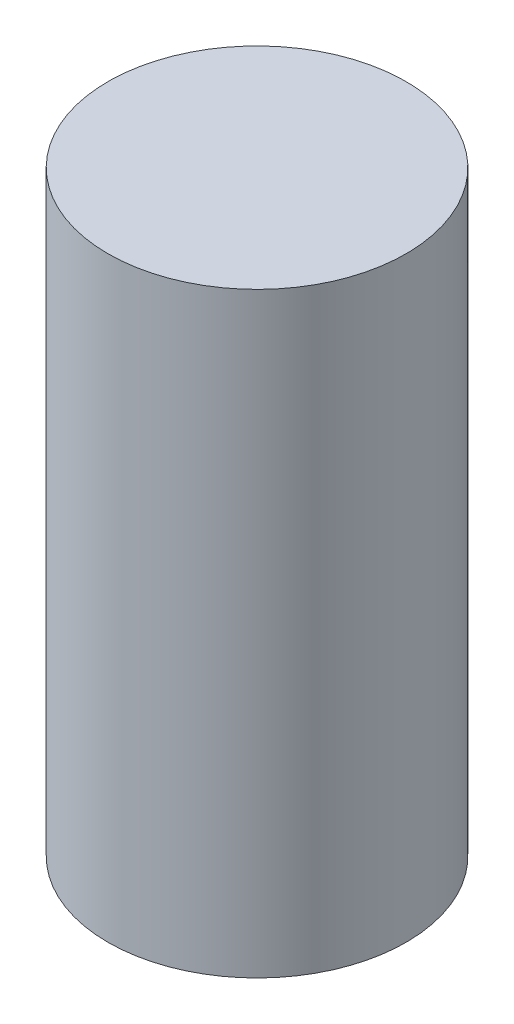
ISO-10303-21;
HEADER;
FILE_DESCRIPTION(('STEP AP214'),'2;1');
FILE_NAME('part.step','',(''),(''),'','','');
FILE_SCHEMA(('AUTOMOTIVE_DESIGN { 1 0 10303 214 1 1 1 1 }'));
ENDSEC;
DATA;
#1=APPLICATION_CONTEXT('core data for automotive mechanical design processes');
#2=APPLICATION_PROTOCOL_DEFINITION('international standard','automotive_design',2000,#1);
#3=PRODUCT_CONTEXT('',#1,'mechanical');
#4=PRODUCT('Part','Part','',(#3));
#5=PRODUCT_RELATED_PRODUCT_CATEGORY('part','',(#4));
#6=PRODUCT_DEFINITION_FORMATION('','',#4);
#7=PRODUCT_DEFINITION_CONTEXT('part definition',#1,'design');
#8=PRODUCT_DEFINITION('design','',#6,#7);
#9=PRODUCT_DEFINITION_SHAPE('','',#8);
#10=(LENGTH_UNIT() NAMED_UNIT(*) SI_UNIT(.MILLI.,.METRE.));
#11=(NAMED_UNIT(*) PLANE_ANGLE_UNIT() SI_UNIT($,.RADIAN.));
#12=(NAMED_UNIT(*) SI_UNIT($,.STERADIAN.) SOLID_ANGLE_UNIT());
#13=UNCERTAINTY_MEASURE_WITH_UNIT(LENGTH_MEASURE(1.E-05),#10,'distance_accuracy_value','');
#14=(GEOMETRIC_REPRESENTATION_CONTEXT(3) GLOBAL_UNCERTAINTY_ASSIGNED_CONTEXT((#13)) GLOBAL_UNIT_ASSIGNED_CONTEXT((#10,
#11,#12)) REPRESENTATION_CONTEXT('',''));
#15=CARTESIAN_POINT('',(0.,0.,0.));
#16=DIRECTION('',(0.,0.,1.));
#17=DIRECTION('',(1.,0.,0.));
#18=AXIS2_PLACEMENT_3D('',#15,#16,#17);
#19=CARTESIAN_POINT('',(0.,5.,0.));
#20=DIRECTION('',(0.,-1.,0.));
#21=DIRECTION('',(0.,0.,-1.));
#22=AXIS2_PLACEMENT_3D('',#19,#20,#21);
#23=CYLINDRICAL_SURFACE('',#22,1.25);
#24=CARTESIAN_POINT('',(0.,5.,0.));
#25=DIRECTION('',(0.,1.,0.));
#26=DIRECTION('',(0.,0.,1.));
#27=AXIS2_PLACEMENT_3D('',#24,#25,#26);
#28=CIRCLE('',#27,1.25);
#29=CARTESIAN_POINT('',(0.,5.,1.25));
#30=VERTEX_POINT('',#29);
#31=EDGE_CURVE('E10',#30,#30,#28,.T.);
#32=ORIENTED_EDGE('',*,*,#31,.F.);
#33=EDGE_LOOP('',(#32));
#34=FACE_BOUND('',#33,.T.);
#35=CARTESIAN_POINT('',(0.,0.,0.));
#36=DIRECTION('',(0.,1.,0.));
#37=DIRECTION('',(0.,0.,1.));
#38=AXIS2_PLACEMENT_3D('',#35,#36,#37);
#39=CIRCLE('',#38,1.25);
#40=CARTESIAN_POINT('',(0.,0.,1.25));
#41=VERTEX_POINT('',#40);
#42=EDGE_CURVE('E44',#41,#41,#39,.T.);
#43=ORIENTED_EDGE('',*,*,#42,.T.);
#44=EDGE_LOOP('',(#43));
#45=FACE_BOUND('',#44,.T.);
#46=ADVANCED_FACE('F41',(#34,#45),#23,.T.);
#47=CARTESIAN_POINT('',(0.,5.,0.));
#48=DIRECTION('',(0.,1.,0.));
#49=DIRECTION('',(0.,0.,1.));
#50=AXIS2_PLACEMENT_3D('',#47,#48,#49);
#51=PLANE('',#50);
#52=ORIENTED_EDGE('',*,*,#31,.T.);
#53=EDGE_LOOP('',(#52));
#54=FACE_BOUND('',#53,.T.);
#55=ADVANCED_FACE('F56',(#54),#51,.T.);
#56=CARTESIAN_POINT('',(0.,0.,0.));
#57=DIRECTION('',(0.,1.,0.));
#58=DIRECTION('',(0.,0.,1.));
#59=AXIS2_PLACEMENT_3D('',#56,#57,#58);
#60=PLANE('',#59);
#61=ORIENTED_EDGE('',*,*,#42,.F.);
#62=EDGE_LOOP('',(#61));
#63=FACE_BOUND('',#62,.T.);
#64=ADVANCED_FACE('F54',(#63),#60,.F.);
#65=CLOSED_SHELL('',(#46,#55,#64));
#66=MANIFOLD_SOLID_BREP('B2',#65);
#67=ADVANCED_BREP_SHAPE_REPRESENTATION('',(#18,#66),#14);
#68=SHAPE_DEFINITION_REPRESENTATION(#9,#67);
ENDSEC;
END-ISO-10303-21;
